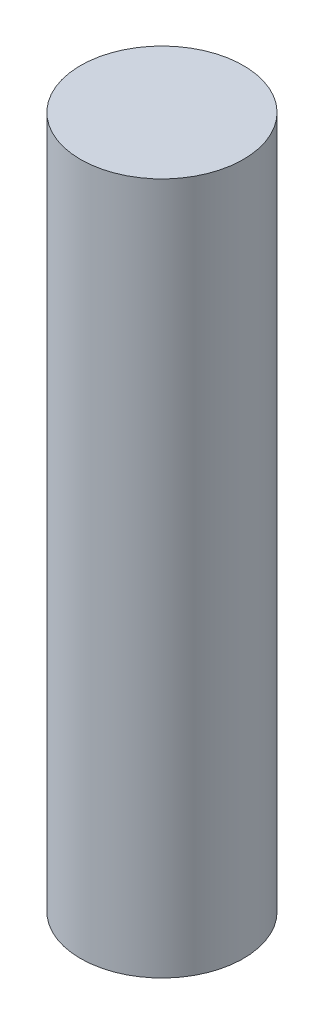
ISO-10303-21;
HEADER;
FILE_DESCRIPTION(('STEP AP214'),'2;1');
FILE_NAME('part.step','',(''),(''),'','','');
FILE_SCHEMA(('AUTOMOTIVE_DESIGN { 1 0 10303 214 1 1 1 1 }'));
ENDSEC;
DATA;
#1=APPLICATION_CONTEXT('core data for automotive mechanical design processes');
#2=APPLICATION_PROTOCOL_DEFINITION('international standard','automotive_design',2000,#1);
#3=PRODUCT_CONTEXT('',#1,'mechanical');
#4=PRODUCT('Part','Part','',(#3));
#5=PRODUCT_RELATED_PRODUCT_CATEGORY('part','',(#4));
#6=PRODUCT_DEFINITION_FORMATION('','',#4);
#7=PRODUCT_DEFINITION_CONTEXT('part definition',#1,'design');
#8=PRODUCT_DEFINITION('design','',#6,#7);
#9=PRODUCT_DEFINITION_SHAPE('','',#8);
#10=(LENGTH_UNIT() NAMED_UNIT(*) SI_UNIT(.MILLI.,.METRE.));
#11=(NAMED_UNIT(*) PLANE_ANGLE_UNIT() SI_UNIT($,.RADIAN.));
#12=(NAMED_UNIT(*) SI_UNIT($,.STERADIAN.) SOLID_ANGLE_UNIT());
#13=UNCERTAINTY_MEASURE_WITH_UNIT(LENGTH_MEASURE(1.E-05),#10,'distance_accuracy_value','');
#14=(GEOMETRIC_REPRESENTATION_CONTEXT(3) GLOBAL_UNCERTAINTY_ASSIGNED_CONTEXT((#13)) GLOBAL_UNIT_ASSIGNED_CONTEXT((#10,
#11,#12)) REPRESENTATION_CONTEXT('',''));
#15=CARTESIAN_POINT('',(0.,0.,0.));
#16=DIRECTION('',(0.,0.,1.));
#17=DIRECTION('',(1.,0.,0.));
#18=AXIS2_PLACEMENT_3D('',#15,#16,#17);
#19=CARTESIAN_POINT('',(0.,85.,0.));
#20=DIRECTION('',(0.,-1.,0.));
#21=DIRECTION('',(0.,0.,-1.));
#22=AXIS2_PLACEMENT_3D('',#19,#20,#21);
#23=CYLINDRICAL_SURFACE('',#22,10.);
#24=CARTESIAN_POINT('',(0.,85.,0.));
#25=DIRECTION('',(0.,1.,0.));
#26=DIRECTION('',(0.,0.,1.));
#27=AXIS2_PLACEMENT_3D('',#24,#25,#26);
#28=CIRCLE('',#27,10.);
#29=CARTESIAN_POINT('',(0.,85.,10.));
#30=VERTEX_POINT('',#29);
#31=EDGE_CURVE('E12',#30,#30,#28,.T.);
#32=ORIENTED_EDGE('',*,*,#31,.F.);
#33=EDGE_LOOP('',(#32));
#34=FACE_BOUND('',#33,.T.);
#35=CARTESIAN_POINT('',(0.,0.,0.));
#36=DIRECTION('',(0.,1.,0.));
#37=DIRECTION('',(0.,0.,1.));
#38=AXIS2_PLACEMENT_3D('',#35,#36,#37);
#39=CIRCLE('',#38,10.);
#40=CARTESIAN_POINT('',(0.,0.,10.));
#41=VERTEX_POINT('',#40);
#42=EDGE_CURVE('E49',#41,#41,#39,.T.);
#43=ORIENTED_EDGE('',*,*,#42,.T.);
#44=EDGE_LOOP('',(#43));
#45=FACE_BOUND('',#44,.T.);
#46=ADVANCED_FACE('F46',(#34,#45),#23,.T.);
#47=CARTESIAN_POINT('',(0.,85.,0.));
#48=DIRECTION('',(0.,1.,0.));
#49=DIRECTION('',(0.,0.,1.));
#50=AXIS2_PLACEMENT_3D('',#47,#48,#49);
#51=PLANE('',#50);
#52=ORIENTED_EDGE('',*,*,#31,.T.);
#53=EDGE_LOOP('',(#52));
#54=FACE_BOUND('',#53,.T.);
#55=ADVANCED_FACE('F75',(#54),#51,.T.);
#56=CARTESIAN_POINT('',(0.,0.,0.));
#57=DIRECTION('',(0.,1.,0.));
#58=DIRECTION('',(0.,0.,1.));
#59=AXIS2_PLACEMENT_3D('',#56,#57,#58);
#60=PLANE('',#59);
#61=CARTESIAN_POINT('',(0.,0.,0.));
#62=DIRECTION('',(0.,-1.,0.));
#63=DIRECTION('',(0.,0.,-1.));
#64=AXIS2_PLACEMENT_3D('',#61,#62,#63);
#65=CIRCLE('',#64,2.);
#66=CARTESIAN_POINT('',(0.,0.,-2.));
#67=VERTEX_POINT('',#66);
#68=EDGE_CURVE('E58',#67,#67,#65,.T.);
#69=ORIENTED_EDGE('',*,*,#68,.F.);
#70=EDGE_LOOP('',(#69));
#71=FACE_BOUND('',#70,.T.);
#72=ORIENTED_EDGE('',*,*,#42,.F.);
#73=EDGE_LOOP('',(#72));
#74=FACE_BOUND('',#73,.T.);
#75=ADVANCED_FACE('F69',(#71,#74),#60,.F.);
#76=CARTESIAN_POINT('',(0.,60.,0.));
#77=DIRECTION('',(0.,-1.,0.));
#78=DIRECTION('',(0.,0.,-1.));
#79=AXIS2_PLACEMENT_3D('',#76,#77,#78);
#80=CYLINDRICAL_SURFACE('',#79,2.);
#81=CARTESIAN_POINT('',(0.,60.,0.));
#82=DIRECTION('',(0.,-1.,0.));
#83=DIRECTION('',(0.,0.,-1.));
#84=AXIS2_PLACEMENT_3D('',#81,#82,#83);
#85=CIRCLE('',#84,2.);
#86=CARTESIAN_POINT('',(0.,60.,-2.));
#87=VERTEX_POINT('',#86);
#88=EDGE_CURVE('E56',#87,#87,#85,.T.);
#89=ORIENTED_EDGE('',*,*,#88,.F.);
#90=EDGE_LOOP('',(#89));
#91=FACE_BOUND('',#90,.T.);
#92=ORIENTED_EDGE('',*,*,#68,.T.);
#93=EDGE_LOOP('',(#92));
#94=FACE_BOUND('',#93,.T.);
#95=ADVANCED_FACE('F66',(#91,#94),#80,.F.);
#96=CARTESIAN_POINT('',(0.,60.,0.));
#97=DIRECTION('',(0.,-1.,0.));
#98=DIRECTION('',(0.,0.,-1.));
#99=AXIS2_PLACEMENT_3D('',#96,#97,#98);
#100=PLANE('',#99);
#101=ORIENTED_EDGE('',*,*,#88,.T.);
#102=EDGE_LOOP('',(#101));
#103=FACE_BOUND('',#102,.T.);
#104=ADVANCED_FACE('F64',(#103),#100,.T.);
#105=CLOSED_SHELL('',(#46,#55,#75,#95,#104));
#106=MANIFOLD_SOLID_BREP('B2',#105);
#107=ADVANCED_BREP_SHAPE_REPRESENTATION('',(#18,#106),#14);
#108=SHAPE_DEFINITION_REPRESENTATION(#9,#107);
ENDSEC;
END-ISO-10303-21;
